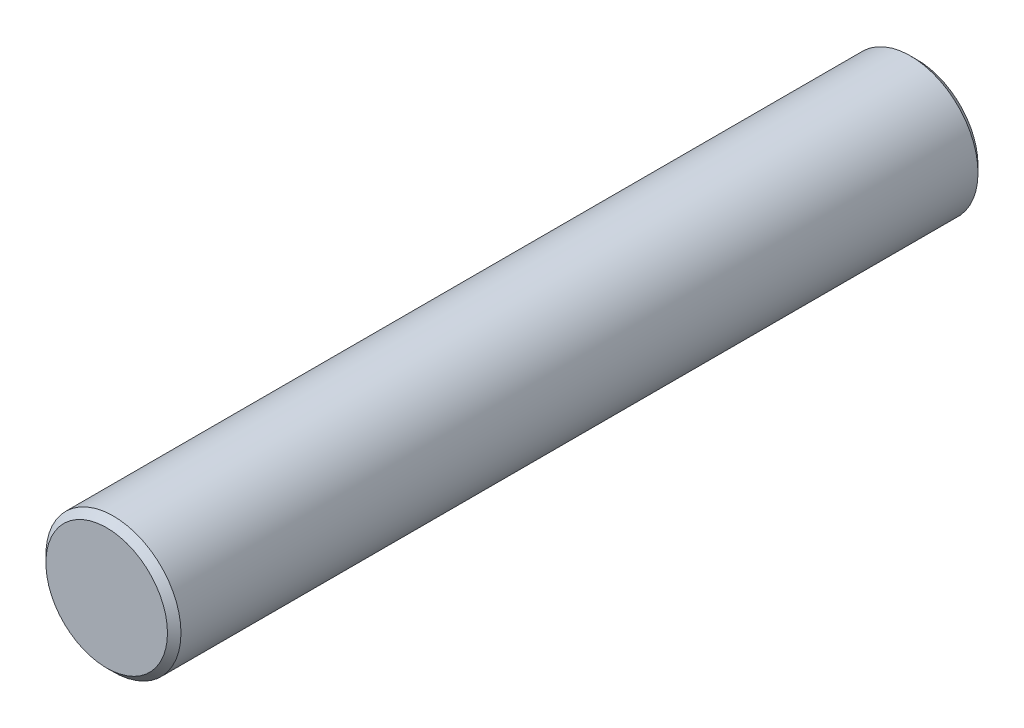
ISO-10303-21;
HEADER;
FILE_DESCRIPTION(('STEP AP214'),'2;1');
FILE_NAME('part.step','',(''),(''),'','','');
FILE_SCHEMA(('AUTOMOTIVE_DESIGN { 1 0 10303 214 1 1 1 1 }'));
ENDSEC;
DATA;
#1=APPLICATION_CONTEXT('core data for automotive mechanical design processes');
#2=APPLICATION_PROTOCOL_DEFINITION('international standard','automotive_design',2000,#1);
#3=PRODUCT_CONTEXT('',#1,'mechanical');
#4=PRODUCT('Part','Part','',(#3));
#5=PRODUCT_RELATED_PRODUCT_CATEGORY('part','',(#4));
#6=PRODUCT_DEFINITION_FORMATION('','',#4);
#7=PRODUCT_DEFINITION_CONTEXT('part definition',#1,'design');
#8=PRODUCT_DEFINITION('design','',#6,#7);
#9=PRODUCT_DEFINITION_SHAPE('','',#8);
#10=(LENGTH_UNIT() NAMED_UNIT(*) SI_UNIT(.MILLI.,.METRE.));
#11=(NAMED_UNIT(*) PLANE_ANGLE_UNIT() SI_UNIT($,.RADIAN.));
#12=(NAMED_UNIT(*) SI_UNIT($,.STERADIAN.) SOLID_ANGLE_UNIT());
#13=UNCERTAINTY_MEASURE_WITH_UNIT(LENGTH_MEASURE(1.E-05),#10,'distance_accuracy_value','');
#14=(GEOMETRIC_REPRESENTATION_CONTEXT(3) GLOBAL_UNCERTAINTY_ASSIGNED_CONTEXT((#13)) GLOBAL_UNIT_ASSIGNED_CONTEXT((#10,
#11,#12)) REPRESENTATION_CONTEXT('',''));
#15=CARTESIAN_POINT('',(0.,0.,0.));
#16=DIRECTION('',(0.,0.,1.));
#17=DIRECTION('',(1.,0.,0.));
#18=AXIS2_PLACEMENT_3D('',#15,#16,#17);
#19=CARTESIAN_POINT('',(0.,0.,30.));
#20=DIRECTION('',(0.,0.,-1.));
#21=DIRECTION('',(-1.,0.,0.));
#22=AXIS2_PLACEMENT_3D('',#19,#20,#21);
#23=CYLINDRICAL_SURFACE('',#22,2.5);
#24=CARTESIAN_POINT('',(0.,0.,0.25));
#25=DIRECTION('',(0.,0.,1.));
#26=DIRECTION('',(1.,0.,0.));
#27=AXIS2_PLACEMENT_3D('',#24,#25,#26);
#28=CIRCLE('',#27,2.5);
#29=CARTESIAN_POINT('',(2.5,0.,0.25));
#30=VERTEX_POINT('',#29);
#31=EDGE_CURVE('E39',#30,#30,#28,.T.);
#32=ORIENTED_EDGE('',*,*,#31,.T.);
#33=EDGE_LOOP('',(#32));
#34=FACE_BOUND('',#33,.T.);
#35=CARTESIAN_POINT('',(0.,0.,29.75));
#36=DIRECTION('',(0.,0.,1.));
#37=DIRECTION('',(1.,0.,0.));
#38=AXIS2_PLACEMENT_3D('',#35,#36,#37);
#39=CIRCLE('',#38,2.5);
#40=CARTESIAN_POINT('',(2.5,0.,29.75));
#41=VERTEX_POINT('',#40);
#42=EDGE_CURVE('E43',#41,#41,#39,.F.);
#43=ORIENTED_EDGE('',*,*,#42,.T.);
#44=EDGE_LOOP('',(#43));
#45=FACE_BOUND('',#44,.T.);
#46=ADVANCED_FACE('F29',(#34,#45),#23,.T.);
#47=CARTESIAN_POINT('',(0.,0.,30.));
#48=DIRECTION('',(0.,0.,1.));
#49=DIRECTION('',(1.,0.,0.));
#50=AXIS2_PLACEMENT_3D('',#47,#48,#49);
#51=PLANE('',#50);
#52=CARTESIAN_POINT('',(0.,0.,30.));
#53=DIRECTION('',(0.,0.,1.));
#54=DIRECTION('',(1.,0.,0.));
#55=AXIS2_PLACEMENT_3D('',#52,#53,#54);
#56=CIRCLE('',#55,2.25);
#57=CARTESIAN_POINT('',(2.25,0.,30.));
#58=VERTEX_POINT('',#57);
#59=EDGE_CURVE('E10',#58,#58,#56,.T.);
#60=ORIENTED_EDGE('',*,*,#59,.T.);
#61=EDGE_LOOP('',(#60));
#62=FACE_BOUND('',#61,.T.);
#63=ADVANCED_FACE('F62',(#62),#51,.T.);
#64=CARTESIAN_POINT('',(0.,0.,0.));
#65=DIRECTION('',(0.,0.,1.));
#66=DIRECTION('',(1.,0.,0.));
#67=AXIS2_PLACEMENT_3D('',#64,#65,#66);
#68=PLANE('',#67);
#69=CARTESIAN_POINT('',(0.,0.,0.));
#70=DIRECTION('',(0.,0.,1.));
#71=DIRECTION('',(1.,0.,0.));
#72=AXIS2_PLACEMENT_3D('',#69,#70,#71);
#73=CIRCLE('',#72,2.25);
#74=CARTESIAN_POINT('',(2.25,0.,0.));
#75=VERTEX_POINT('',#74);
#76=EDGE_CURVE('E35',#75,#75,#73,.F.);
#77=ORIENTED_EDGE('',*,*,#76,.T.);
#78=EDGE_LOOP('',(#77));
#79=FACE_BOUND('',#78,.T.);
#80=ADVANCED_FACE('F58',(#79),#68,.F.);
#81=CARTESIAN_POINT('',(0.,0.,0.25));
#82=DIRECTION('',(0.,0.,1.));
#83=DIRECTION('',(1.,0.,0.));
#84=AXIS2_PLACEMENT_3D('',#81,#82,#83);
#85=CONICAL_SURFACE('',#84,2.5,0.785398163397457);
#86=ORIENTED_EDGE('',*,*,#76,.F.);
#87=EDGE_LOOP('',(#86));
#88=FACE_BOUND('',#87,.T.);
#89=ORIENTED_EDGE('',*,*,#31,.F.);
#90=EDGE_LOOP('',(#89));
#91=FACE_BOUND('',#90,.T.);
#92=ADVANCED_FACE('F53',(#88,#91),#85,.T.);
#93=CARTESIAN_POINT('',(0.,0.,30.));
#94=DIRECTION('',(0.,0.,-1.));
#95=DIRECTION('',(-1.,0.,0.));
#96=AXIS2_PLACEMENT_3D('',#93,#94,#95);
#97=CONICAL_SURFACE('',#96,2.25,0.785398163397457);
#98=ORIENTED_EDGE('',*,*,#42,.F.);
#99=EDGE_LOOP('',(#98));
#100=FACE_BOUND('',#99,.T.);
#101=ORIENTED_EDGE('',*,*,#59,.F.);
#102=EDGE_LOOP('',(#101));
#103=FACE_BOUND('',#102,.T.);
#104=ADVANCED_FACE('F50',(#100,#103),#97,.T.);
#105=CLOSED_SHELL('',(#46,#63,#80,#92,#104));
#106=MANIFOLD_SOLID_BREP('B2',#105);
#107=ADVANCED_BREP_SHAPE_REPRESENTATION('',(#18,#106),#14);
#108=SHAPE_DEFINITION_REPRESENTATION(#9,#107);
ENDSEC;
END-ISO-10303-21;
